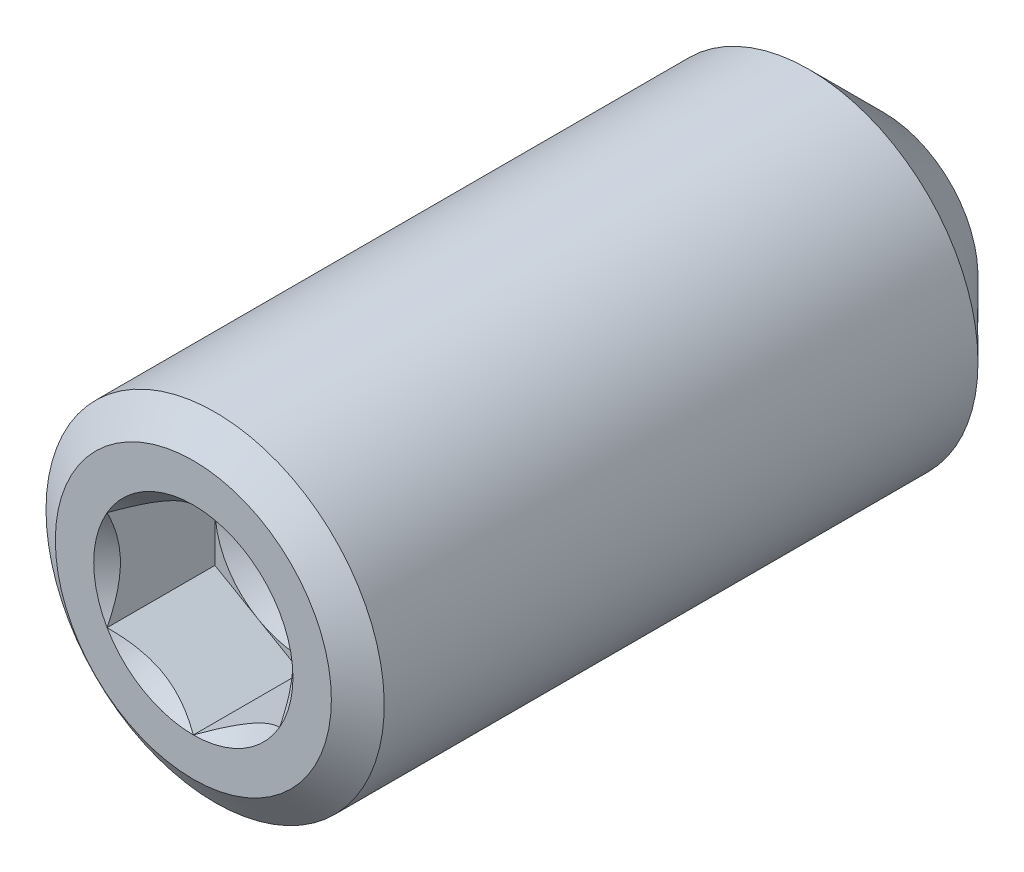
ISO-10303-21;
HEADER;
FILE_DESCRIPTION(('STEP AP214'),'2;1');
FILE_NAME('part.step','',(''),(''),'','','');
FILE_SCHEMA(('AUTOMOTIVE_DESIGN { 1 0 10303 214 1 1 1 1 }'));
ENDSEC;
DATA;
#1=APPLICATION_CONTEXT('core data for automotive mechanical design processes');
#2=APPLICATION_PROTOCOL_DEFINITION('international standard','automotive_design',2000,#1);
#3=PRODUCT_CONTEXT('',#1,'mechanical');
#4=PRODUCT('Part','Part','',(#3));
#5=PRODUCT_RELATED_PRODUCT_CATEGORY('part','',(#4));
#6=PRODUCT_DEFINITION_FORMATION('','',#4);
#7=PRODUCT_DEFINITION_CONTEXT('part definition',#1,'design');
#8=PRODUCT_DEFINITION('design','',#6,#7);
#9=PRODUCT_DEFINITION_SHAPE('','',#8);
#10=(LENGTH_UNIT() NAMED_UNIT(*) SI_UNIT(.MILLI.,.METRE.));
#11=(NAMED_UNIT(*) PLANE_ANGLE_UNIT() SI_UNIT($,.RADIAN.));
#12=(NAMED_UNIT(*) SI_UNIT($,.STERADIAN.) SOLID_ANGLE_UNIT());
#13=UNCERTAINTY_MEASURE_WITH_UNIT(LENGTH_MEASURE(1.E-05),#10,'distance_accuracy_value','');
#14=(GEOMETRIC_REPRESENTATION_CONTEXT(3) GLOBAL_UNCERTAINTY_ASSIGNED_CONTEXT((#13)) GLOBAL_UNIT_ASSIGNED_CONTEXT((#10,
#11,#12)) REPRESENTATION_CONTEXT('',''));
#15=CARTESIAN_POINT('',(0.,0.,0.));
#16=DIRECTION('',(0.,0.,1.));
#17=DIRECTION('',(1.,0.,0.));
#18=AXIS2_PLACEMENT_3D('',#15,#16,#17);
#19=CARTESIAN_POINT('',(0.,0.,3.02593683397845));
#20=DIRECTION('',(0.,0.,1.));
#21=DIRECTION('',(1.,0.,0.));
#22=AXIS2_PLACEMENT_3D('',#19,#20,#21);
#23=CONICAL_SURFACE('',#22,1.25000000002728,1.04719755119718);
#24=CARTESIAN_POINT('',(0.,0.,3.02593683397845));
#25=DIRECTION('',(0.,0.,1.));
#26=DIRECTION('',(1.,0.,0.));
#27=AXIS2_PLACEMENT_3D('',#24,#25,#26);
#28=CIRCLE('',#27,1.25000000002728);
#29=CARTESIAN_POINT('',(-1.25000000001364,0.,3.02593683398803));
#30=VERTEX_POINT('',#29);
#31=CARTESIAN_POINT('',(-0.625000000006821,1.08253175474237,3.02593683398803));
#32=VERTEX_POINT('',#31);
#33=EDGE_CURVE('E93',#30,#32,#28,.F.);
#34=ORIENTED_EDGE('',*,*,#33,.F.);
#35=CARTESIAN_POINT('',(0.,0.,3.02593683397845));
#36=DIRECTION('',(0.,0.,1.));
#37=DIRECTION('',(1.,0.,0.));
#38=AXIS2_PLACEMENT_3D('',#35,#36,#37);
#39=CIRCLE('',#38,1.25000000002728);
#40=CARTESIAN_POINT('',(-0.625000000006821,-1.08253175474236,3.02593683398803));
#41=VERTEX_POINT('',#40);
#42=EDGE_CURVE('E20',#41,#30,#39,.F.);
#43=ORIENTED_EDGE('',*,*,#42,.F.);
#44=CARTESIAN_POINT('',(0.,0.,3.02593683397845));
#45=DIRECTION('',(0.,0.,1.));
#46=DIRECTION('',(1.,0.,0.));
#47=AXIS2_PLACEMENT_3D('',#44,#45,#46);
#48=CIRCLE('',#47,1.25000000002728);
#49=CARTESIAN_POINT('',(0.625000000006821,-1.08253175474236,3.02593683398803));
#50=VERTEX_POINT('',#49);
#51=EDGE_CURVE('E90',#50,#41,#48,.F.);
#52=ORIENTED_EDGE('',*,*,#51,.F.);
#53=CARTESIAN_POINT('',(0.,0.,3.02593683397845));
#54=DIRECTION('',(0.,0.,1.));
#55=DIRECTION('',(1.,0.,0.));
#56=AXIS2_PLACEMENT_3D('',#53,#54,#55);
#57=CIRCLE('',#56,1.25000000002728);
#58=CARTESIAN_POINT('',(1.25000000001364,0.,3.02593683398803));
#59=VERTEX_POINT('',#58);
#60=EDGE_CURVE('E113',#59,#50,#57,.F.);
#61=ORIENTED_EDGE('',*,*,#60,.F.);
#62=CARTESIAN_POINT('',(0.,0.,3.02593683397845));
#63=DIRECTION('',(0.,0.,1.));
#64=DIRECTION('',(1.,0.,0.));
#65=AXIS2_PLACEMENT_3D('',#62,#63,#64);
#66=CIRCLE('',#65,1.25000000002728);
#67=CARTESIAN_POINT('',(0.62500000000682,1.08253175474236,3.02593683398803));
#68=VERTEX_POINT('',#67);
#69=EDGE_CURVE('E346',#68,#59,#66,.F.);
#70=ORIENTED_EDGE('',*,*,#69,.F.);
#71=CARTESIAN_POINT('',(0.,0.,3.02593683397845));
#72=DIRECTION('',(0.,0.,1.));
#73=DIRECTION('',(1.,0.,0.));
#74=AXIS2_PLACEMENT_3D('',#71,#72,#73);
#75=CIRCLE('',#74,1.25000000002728);
#76=EDGE_CURVE('E350',#32,#68,#75,.F.);
#77=ORIENTED_EDGE('',*,*,#76,.F.);
#78=EDGE_LOOP('',(#34,#43,#52,#61,#70,#77));
#79=FACE_BOUND('',#78,.T.);
#80=CARTESIAN_POINT('',(-1.70530256582424E-10,0.,2.30424899757509));
#81=VERTEX_POINT('',#80);
#82=VERTEX_LOOP('',#81);
#83=FACE_BOUND('',#82,.T.);
#84=ADVANCED_FACE('F17',(#79,#83),#23,.F.);
#85=CARTESIAN_POINT('',(-1.25,2.1650635094611,3.02593683399762));
#86=DIRECTION('',(0.,0.,1.));
#87=DIRECTION('',(1.,0.,0.));
#88=AXIS2_PLACEMENT_3D('',#85,#86,#87);
#89=PLANE('',#88);
#90=DIRECTION('',(0.,-1.,0.));
#91=VECTOR('',#90,1.);
#92=CARTESIAN_POINT('',(-1.25,0.721687836487036,3.02593683399762));
#93=LINE('',#92,#91);
#94=CARTESIAN_POINT('',(-1.24999999999998,-0.721687836487046,3.02593683399762));
#95=VERTEX_POINT('',#94);
#96=EDGE_CURVE('E100',#30,#95,#93,.T.);
#97=ORIENTED_EDGE('',*,*,#96,.T.);
#98=DIRECTION('',(0.866025403784438,-0.5,0.));
#99=VECTOR('',#98,1.);
#100=CARTESIAN_POINT('',(-1.25,-0.721687836487028,3.02593683399762));
#101=LINE('',#100,#99);
#102=EDGE_CURVE('E98',#95,#41,#101,.T.);
#103=ORIENTED_EDGE('',*,*,#102,.T.);
#104=ORIENTED_EDGE('',*,*,#42,.T.);
#105=EDGE_LOOP('',(#97,#103,#104));
#106=FACE_BOUND('',#105,.T.);
#107=ADVANCED_FACE('F99',(#106),#89,.T.);
#108=CARTESIAN_POINT('',(-1.25,2.1650635094611,3.02593683399762));
#109=DIRECTION('',(0.,0.,1.));
#110=DIRECTION('',(1.,0.,0.));
#111=AXIS2_PLACEMENT_3D('',#108,#109,#110);
#112=PLANE('',#111);
#113=DIRECTION('',(0.866025403784438,-0.5,0.));
#114=VECTOR('',#113,1.);
#115=CARTESIAN_POINT('',(-1.25,-0.721687836487028,3.02593683399762));
#116=LINE('',#115,#114);
#117=CARTESIAN_POINT('',(0.,-1.44337567297406,3.02593683399762));
#118=VERTEX_POINT('',#117);
#119=EDGE_CURVE('E105',#41,#118,#116,.T.);
#120=ORIENTED_EDGE('',*,*,#119,.T.);
#121=DIRECTION('',(0.866025403784439,0.5,0.));
#122=VECTOR('',#121,1.);
#123=CARTESIAN_POINT('',(0.,-1.44337567297406,3.02593683399762));
#124=LINE('',#123,#122);
#125=EDGE_CURVE('E111',#118,#50,#124,.T.);
#126=ORIENTED_EDGE('',*,*,#125,.T.);
#127=ORIENTED_EDGE('',*,*,#51,.T.);
#128=EDGE_LOOP('',(#120,#126,#127));
#129=FACE_BOUND('',#128,.T.);
#130=ADVANCED_FACE('F108',(#129),#112,.T.);
#131=CARTESIAN_POINT('',(-1.25,2.1650635094611,3.02593683399762));
#132=DIRECTION('',(0.,0.,1.));
#133=DIRECTION('',(1.,0.,0.));
#134=AXIS2_PLACEMENT_3D('',#131,#132,#133);
#135=PLANE('',#134);
#136=DIRECTION('',(0.866025403784439,0.5,0.));
#137=VECTOR('',#136,1.);
#138=CARTESIAN_POINT('',(0.,-1.44337567297406,3.02593683399762));
#139=LINE('',#138,#137);
#140=CARTESIAN_POINT('',(1.25,-0.721687836487004,3.02593683399762));
#141=VERTEX_POINT('',#140);
#142=EDGE_CURVE('E127',#50,#141,#139,.T.);
#143=ORIENTED_EDGE('',*,*,#142,.T.);
#144=DIRECTION('',(0.,1.,0.));
#145=VECTOR('',#144,1.);
#146=CARTESIAN_POINT('',(1.25,-0.721687836487031,3.02593683399762));
#147=LINE('',#146,#145);
#148=EDGE_CURVE('E310',#141,#59,#147,.T.);
#149=ORIENTED_EDGE('',*,*,#148,.T.);
#150=ORIENTED_EDGE('',*,*,#60,.T.);
#151=EDGE_LOOP('',(#143,#149,#150));
#152=FACE_BOUND('',#151,.T.);
#153=ADVANCED_FACE('F341',(#152),#135,.T.);
#154=CARTESIAN_POINT('',(-1.25,2.1650635094611,3.02593683399762));
#155=DIRECTION('',(0.,0.,1.));
#156=DIRECTION('',(1.,0.,0.));
#157=AXIS2_PLACEMENT_3D('',#154,#155,#156);
#158=PLANE('',#157);
#159=DIRECTION('',(0.,1.,0.));
#160=VECTOR('',#159,1.);
#161=CARTESIAN_POINT('',(1.25,-0.721687836487031,3.02593683399762));
#162=LINE('',#161,#160);
#163=CARTESIAN_POINT('',(1.24999999999996,0.721687836487064,3.02593683399762));
#164=VERTEX_POINT('',#163);
#165=EDGE_CURVE('E306',#59,#164,#162,.T.);
#166=ORIENTED_EDGE('',*,*,#165,.T.);
#167=DIRECTION('',(-0.866025403784439,0.5,0.));
#168=VECTOR('',#167,1.);
#169=CARTESIAN_POINT('',(1.25,0.721687836487033,3.02593683399762));
#170=LINE('',#169,#168);
#171=EDGE_CURVE('E305',#164,#68,#170,.T.);
#172=ORIENTED_EDGE('',*,*,#171,.T.);
#173=ORIENTED_EDGE('',*,*,#69,.T.);
#174=EDGE_LOOP('',(#166,#172,#173));
#175=FACE_BOUND('',#174,.T.);
#176=ADVANCED_FACE('F347',(#175),#158,.T.);
#177=CARTESIAN_POINT('',(-1.25,2.1650635094611,3.02593683399762));
#178=DIRECTION('',(0.,0.,1.));
#179=DIRECTION('',(1.,0.,0.));
#180=AXIS2_PLACEMENT_3D('',#177,#178,#179);
#181=PLANE('',#180);
#182=DIRECTION('',(-0.866025403784439,0.5,0.));
#183=VECTOR('',#182,1.);
#184=CARTESIAN_POINT('',(1.25,0.721687836487033,3.02593683399762));
#185=LINE('',#184,#183);
#186=CARTESIAN_POINT('',(0.,1.44337567297407,3.02593683399762));
#187=VERTEX_POINT('',#186);
#188=EDGE_CURVE('E299',#68,#187,#185,.T.);
#189=ORIENTED_EDGE('',*,*,#188,.T.);
#190=DIRECTION('',(-0.866025403784439,-0.5,0.));
#191=VECTOR('',#190,1.);
#192=CARTESIAN_POINT('',(0.,1.44337567297407,3.02593683399762));
#193=LINE('',#192,#191);
#194=EDGE_CURVE('E298',#187,#32,#193,.T.);
#195=ORIENTED_EDGE('',*,*,#194,.T.);
#196=ORIENTED_EDGE('',*,*,#76,.T.);
#197=EDGE_LOOP('',(#189,#195,#196));
#198=FACE_BOUND('',#197,.T.);
#199=ADVANCED_FACE('F359',(#198),#181,.T.);
#200=CARTESIAN_POINT('',(-1.25,2.1650635094611,3.02593683399762));
#201=DIRECTION('',(0.,0.,1.));
#202=DIRECTION('',(1.,0.,0.));
#203=AXIS2_PLACEMENT_3D('',#200,#201,#202);
#204=PLANE('',#203);
#205=DIRECTION('',(-0.866025403784439,-0.5,0.));
#206=VECTOR('',#205,1.);
#207=CARTESIAN_POINT('',(0.,1.44337567297407,3.02593683399762));
#208=LINE('',#207,#206);
#209=CARTESIAN_POINT('',(-1.25,0.721687836487035,3.02593683399762));
#210=VERTEX_POINT('',#209);
#211=EDGE_CURVE('E292',#32,#210,#208,.T.);
#212=ORIENTED_EDGE('',*,*,#211,.T.);
#213=DIRECTION('',(0.,-1.,0.));
#214=VECTOR('',#213,1.);
#215=CARTESIAN_POINT('',(-1.25,0.721687836487036,3.02593683399762));
#216=LINE('',#215,#214);
#217=EDGE_CURVE('E131',#210,#30,#216,.T.);
#218=ORIENTED_EDGE('',*,*,#217,.T.);
#219=ORIENTED_EDGE('',*,*,#33,.T.);
#220=EDGE_LOOP('',(#212,#218,#219));
#221=FACE_BOUND('',#220,.T.);
#222=ADVANCED_FACE('F364',(#221),#204,.T.);
#223=CARTESIAN_POINT('',(-1.25,0.721687836487036,3.02593683399762));
#224=DIRECTION('',(-1.,0.,0.));
#225=DIRECTION('',(0.,-1.,0.));
#226=AXIS2_PLACEMENT_3D('',#223,#224,#225);
#227=PLANE('',#226);
#228=CARTESIAN_POINT('',(-1.25,0.721687836485506,4.58843683400859));
#229=CARTESIAN_POINT('',(-1.25,0.67207831196557,4.56365587372669));
#230=CARTESIAN_POINT('',(-1.25,0.621639311734547,4.54033058347148));
#231=CARTESIAN_POINT('',(-1.25,0.518789014124005,4.49762297291883));
#232=CARTESIAN_POINT('',(-1.25,0.466367941020541,4.478264407358));
#233=CARTESIAN_POINT('',(-1.25,0.360663425295405,4.44510304991205));
#234=CARTESIAN_POINT('',(-1.25,0.307406887809592,4.4312169307825));
#235=CARTESIAN_POINT('',(-1.25,0.199721668828178,4.40982273579902));
#236=CARTESIAN_POINT('',(-1.25,0.14529627466345,4.40229869592082));
#237=CARTESIAN_POINT('',(-1.25,0.0514891518506942,4.39550966179547));
#238=CARTESIAN_POINT('',(-1.25,0.0122284842203182,4.39450502265398));
#239=CARTESIAN_POINT('',(-1.25,-0.066223744792929,4.39620032922052));
#240=CARTESIAN_POINT('',(-1.25,-0.105415288995824,4.39890109326086));
#241=CARTESIAN_POINT('',(-1.25,-0.183420000810623,4.40785108234422));
#242=CARTESIAN_POINT('',(-1.25,-0.222232782388906,4.41410360705652));
#243=CARTESIAN_POINT('',(-1.25,-0.299210321209828,4.42982037324484));
#244=CARTESIAN_POINT('',(-1.25,-0.337374792996399,4.43928599285774));
#245=CARTESIAN_POINT('',(-1.25,-0.435075493648963,4.46736516557929));
#246=CARTESIAN_POINT('',(-1.25,-0.493996912444486,4.48808617906275));
#247=CARTESIAN_POINT('',(-1.25,-0.609534537983697,4.53476033981849));
#248=CARTESIAN_POINT('',(-1.25,-0.666157545656916,4.56069645523039));
#249=CARTESIAN_POINT('',(-1.25,-0.721687836485585,4.58843683400865));
#250=B_SPLINE_CURVE_WITH_KNOTS('',3,(#228,#229,#230,#231,#232,#233,#234,#235,#236,#237,#238,
#239,#240,#241,#242,#243,#244,#245,#246,#247,#248,#249),.UNSPECIFIED.,.F.,.F.,(4,2,2,2,2,2,2,2,
2,2,4),(0.,0.166478683225483,0.333926926832097,0.49871665851735,0.663091654627106,
0.780745575559074,0.898425484352099,1.01621489977086,1.13405490052503,1.32111591641343,
1.50757565758287),.UNSPECIFIED.);
#251=CARTESIAN_POINT('',(-1.25000000000141,0.721687836487026,4.58843683401057));
#252=VERTEX_POINT('',#251);
#253=CARTESIAN_POINT('',(-1.25000000000209,-0.72168783648582,4.58843683401059));
#254=VERTEX_POINT('',#253);
#255=EDGE_CURVE('E235',#252,#254,#250,.T.);
#256=ORIENTED_EDGE('',*,*,#255,.T.);
#257=DIRECTION('',(0.,0.,1.));
#258=VECTOR('',#257,1.);
#259=CARTESIAN_POINT('',(-1.24999999999997,-0.721687836487046,3.02593683399762));
#260=LINE('',#259,#258);
#261=EDGE_CURVE('E117',#254,#95,#260,.F.);
#262=ORIENTED_EDGE('',*,*,#261,.T.);
#263=ORIENTED_EDGE('',*,*,#96,.F.);
#264=ORIENTED_EDGE('',*,*,#217,.F.);
#265=DIRECTION('',(0.,0.,1.));
#266=VECTOR('',#265,1.);
#267=CARTESIAN_POINT('',(-1.25,0.721687836487035,3.02593683399762));
#268=LINE('',#267,#266);
#269=EDGE_CURVE('E288',#210,#252,#268,.T.);
#270=ORIENTED_EDGE('',*,*,#269,.T.);
#271=EDGE_LOOP('',(#256,#262,#263,#264,#270));
#272=FACE_BOUND('',#271,.T.);
#273=ADVANCED_FACE('F226',(#272),#227,.F.);
#274=CARTESIAN_POINT('',(-1.25,-0.721687836487028,3.02593683399762));
#275=DIRECTION('',(-0.5,-0.866025403784438,0.));
#276=DIRECTION('',(0.866025403784438,-0.5,0.));
#277=AXIS2_PLACEMENT_3D('',#274,#275,#276);
#278=PLANE('',#277);
#279=CARTESIAN_POINT('',(-1.24999999999869,-0.721687836487788,4.58843683400862));
#280=CARTESIAN_POINT('',(-1.20703689149475,-0.746492598747757,4.56365587372672));
#281=CARTESIAN_POINT('',(-1.16335543595319,-0.77171209886327,4.54033058347151));
#282=CARTESIAN_POINT('',(-1.07428446543567,-0.823137247668542,4.49762297291886));
#283=CARTESIAN_POINT('',(-1.02888648443443,-0.849347784220275,4.47826440735802));
#284=CARTESIAN_POINT('',(-0.937343688521729,-0.902200042082844,4.44510304991208));
#285=CARTESIAN_POINT('',(-0.891222174141415,-0.928828310825752,4.43121693078252));
#286=CARTESIAN_POINT('',(-0.797964038891418,-0.98267092031646,4.40982273579905));
#287=CARTESIAN_POINT('',(-0.75083026493378,-1.00988361739883,4.40229869592084));
#288=CARTESIAN_POINT('',(-0.669590913522005,-1.0567871788052,4.39550966179549));
#289=CARTESIAN_POINT('',(-0.635590177984561,-1.07641751262039,4.394505022654));
#290=CARTESIAN_POINT('',(-0.567648554675573,-1.11564362712702,4.39620032922055));
#291=CARTESIAN_POINT('',(-0.533707681782325,-1.13523939922847,4.39890109326088));
#292=CARTESIAN_POINT('',(-0.466153619735823,-1.17424175513587,4.40785108234424));
#293=CARTESIAN_POINT('',(-0.432540764897493,-1.19364814592501,4.41410360705654));
#294=CARTESIAN_POINT('',(-0.36587626075777,-1.23213691533547,4.42982037324486));
#295=CARTESIAN_POINT('',(-0.332824858668585,-1.25121915122876,4.43928599285776));
#296=CARTESIAN_POINT('',(-0.248213569935932,-1.30006950155503,4.46736516557931));
#297=CARTESIAN_POINT('',(-0.197186124431993,-1.32953021095279,4.48808617906277));
#298=CARTESIAN_POINT('',(-0.0971276056221142,-1.38729902372239,4.5347603398185));
#299=CARTESIAN_POINT('',(-0.0480906425384311,-1.415610527559,4.5606964552304));
#300=CARTESIAN_POINT('',(-1.27108631816788E-12,-1.44337567297333,4.58843683400866));
#301=B_SPLINE_CURVE_WITH_KNOTS('',3,(#279,#280,#281,#282,#283,#284,#285,#286,#287,#288,#289,
#290,#291,#292,#293,#294,#295,#296,#297,#298,#299,#300),.UNSPECIFIED.,.F.,.F.,(4,2,2,2,2,2,2,2,
2,2,4),(0.,0.166478683225488,0.333926926832108,0.498716658517365,0.663091654627127,
0.780745575559097,0.898425484352125,1.01621489977089,1.13405490052506,1.32111591641343,
1.50757565758286),.UNSPECIFIED.);
#302=CARTESIAN_POINT('',(-2.08582432422679E-12,-1.44337567297527,4.58843683401059));
#303=VERTEX_POINT('',#302);
#304=EDGE_CURVE('E229',#254,#303,#301,.T.);
#305=ORIENTED_EDGE('',*,*,#304,.T.);
#306=DIRECTION('',(0.,0.,1.));
#307=VECTOR('',#306,1.);
#308=CARTESIAN_POINT('',(0.,-1.44337567297405,3.02593683399762));
#309=LINE('',#308,#307);
#310=EDGE_CURVE('E116',#303,#118,#309,.F.);
#311=ORIENTED_EDGE('',*,*,#310,.T.);
#312=ORIENTED_EDGE('',*,*,#119,.F.);
#313=ORIENTED_EDGE('',*,*,#102,.F.);
#314=ORIENTED_EDGE('',*,*,#261,.F.);
#315=EDGE_LOOP('',(#305,#311,#312,#313,#314));
#316=FACE_BOUND('',#315,.T.);
#317=ADVANCED_FACE('F114',(#316),#278,.F.);
#318=CARTESIAN_POINT('',(0.,-1.44337567297406,3.02593683399762));
#319=DIRECTION('',(0.5,-0.866025403784439,0.));
#320=DIRECTION('',(0.866025403784439,0.5,0.));
#321=AXIS2_PLACEMENT_3D('',#318,#319,#320);
#322=PLANE('',#321);
#323=CARTESIAN_POINT('',(1.30846630177461E-12,-1.44337567297331,4.58843683400864));
#324=CARTESIAN_POINT('',(0.0429631085052433,-1.41857091071334,4.56365587372674));
#325=CARTESIAN_POINT('',(0.086644564046802,-1.39335141059782,4.54033058347152));
#326=CARTESIAN_POINT('',(0.175715534564327,-1.34192626179255,4.49762297291887));
#327=CARTESIAN_POINT('',(0.221113515565572,-1.31571572524081,4.47826440735803));
#328=CARTESIAN_POINT('',(0.312656311478277,-1.26286346737824,4.44510304991208));
#329=CARTESIAN_POINT('',(0.358777825858593,-1.23623519863533,4.43121693078253));
#330=CARTESIAN_POINT('',(0.452035961108595,-1.18239258914462,4.40982273579905));
#331=CARTESIAN_POINT('',(0.499169735066234,-1.15517989206226,4.40229869592084));
#332=CARTESIAN_POINT('',(0.580409086478012,-1.10827633065588,4.39550966179549));
#333=CARTESIAN_POINT('',(0.614409822015456,-1.08864599684069,4.394505022654));
#334=CARTESIAN_POINT('',(0.682351445324444,-1.04941988233406,4.39620032922055));
#335=CARTESIAN_POINT('',(0.716292318217692,-1.02982411023262,4.39890109326088));
#336=CARTESIAN_POINT('',(0.783846380264195,-0.990821754325215,4.40785108234424));
#337=CARTESIAN_POINT('',(0.817459235102524,-0.971415363536073,4.41410360705654));
#338=CARTESIAN_POINT('',(0.884123739242248,-0.932926594125612,4.42982037324486));
#339=CARTESIAN_POINT('',(0.917175141331433,-0.913844358232325,4.43928599285776));
#340=CARTESIAN_POINT('',(1.00178643006409,-0.864994007906047,4.46736516557931));
#341=CARTESIAN_POINT('',(1.05281387556803,-0.835533298508289,4.48808617906276));
#342=CARTESIAN_POINT('',(1.1528723943779,-0.77776448573869,4.5347603398185));
#343=CARTESIAN_POINT('',(1.20190935746159,-0.749452981902084,4.5606964552304));
#344=CARTESIAN_POINT('',(1.24999999999875,-0.721687836487752,4.58843683400866));
#345=B_SPLINE_CURVE_WITH_KNOTS('',3,(#323,#324,#325,#326,#327,#328,#329,#330,#331,#332,#333,
#334,#335,#336,#337,#338,#339,#340,#341,#342,#343,#344),.UNSPECIFIED.,.F.,.F.,(4,2,2,2,2,2,2,2,
2,2,4),(0.,0.166478683225496,0.333926926832123,0.498716658517387,0.663091654627158,
0.780745575559128,0.898425484352156,1.01621489977092,1.13405490052509,1.32111591641346,
1.50757565758289),.UNSPECIFIED.);
#346=CARTESIAN_POINT('',(1.25,-0.721687836489449,4.58843683401059));
#347=VERTEX_POINT('',#346);
#348=EDGE_CURVE('E205',#303,#347,#345,.T.);
#349=ORIENTED_EDGE('',*,*,#348,.T.);
#350=DIRECTION('',(0.,0.,-1.));
#351=VECTOR('',#350,1.);
#352=CARTESIAN_POINT('',(1.25,-0.721687836486995,3.02593683399762));
#353=LINE('',#352,#351);
#354=EDGE_CURVE('E302',#347,#141,#353,.T.);
#355=ORIENTED_EDGE('',*,*,#354,.T.);
#356=ORIENTED_EDGE('',*,*,#142,.F.);
#357=ORIENTED_EDGE('',*,*,#125,.F.);
#358=ORIENTED_EDGE('',*,*,#310,.F.);
#359=EDGE_LOOP('',(#349,#355,#356,#357,#358));
#360=FACE_BOUND('',#359,.T.);
#361=ADVANCED_FACE('F216',(#360),#322,.F.);
#362=CARTESIAN_POINT('',(1.25,-0.721687836487031,3.02593683399762));
#363=DIRECTION('',(1.,0.,0.));
#364=DIRECTION('',(0.,0.,-1.));
#365=AXIS2_PLACEMENT_3D('',#362,#363,#364);
#366=PLANE('',#365);
#367=CARTESIAN_POINT('',(1.25,-0.721687836485512,4.58843683400862));
#368=CARTESIAN_POINT('',(1.25,-0.672078311965572,4.56365587372672));
#369=CARTESIAN_POINT('',(1.25,-0.621639311734545,4.54033058347151));
#370=CARTESIAN_POINT('',(1.25,-0.518789014123995,4.49762297291884));
#371=CARTESIAN_POINT('',(1.25,-0.466367941020527,4.47826440735801));
#372=CARTESIAN_POINT('',(1.25,-0.360663425295383,4.44510304991206));
#373=CARTESIAN_POINT('',(1.25,-0.307406887809565,4.4312169307825));
#374=CARTESIAN_POINT('',(1.25,-0.199721668828143,4.40982273579903));
#375=CARTESIAN_POINT('',(1.25,-0.14529627466341,4.40229869592082));
#376=CARTESIAN_POINT('',(1.25,-0.0514891518506491,4.39550966179547));
#377=CARTESIAN_POINT('',(1.25,-0.0122284842202729,4.39450502265398));
#378=CARTESIAN_POINT('',(1.25,0.0662237447929748,4.39620032922052));
#379=CARTESIAN_POINT('',(1.25,0.10541528899587,4.39890109326086));
#380=CARTESIAN_POINT('',(1.25,0.18342000081067,4.40785108234421));
#381=CARTESIAN_POINT('',(1.25,0.222232782388952,4.41410360705652));
#382=CARTESIAN_POINT('',(1.25,0.299210321209875,4.42982037324483));
#383=CARTESIAN_POINT('',(1.25,0.337374792996446,4.43928599285774));
#384=CARTESIAN_POINT('',(1.25,0.435075493649011,4.46736516557928));
#385=CARTESIAN_POINT('',(1.25,0.493996912444534,4.48808617906274));
#386=CARTESIAN_POINT('',(1.25,0.609534537983747,4.53476033981849));
#387=CARTESIAN_POINT('',(1.25,0.666157545656967,4.56069645523039));
#388=CARTESIAN_POINT('',(1.25,0.721687836485637,4.58843683400865));
#389=B_SPLINE_CURVE_WITH_KNOTS('',3,(#367,#368,#369,#370,#371,#372,#373,#374,#375,#376,#377,
#378,#379,#380,#381,#382,#383,#384,#385,#386,#387,#388),.UNSPECIFIED.,.F.,.F.,(4,2,2,2,2,2,2,2,
2,2,4),(0.,0.166478683225497,0.333926926832126,0.498716658517393,0.663091654627164,
0.780745575559132,0.898425484352158,1.01621489977092,1.13405490052509,1.32111591641349,
1.50757565758294),.UNSPECIFIED.);
#390=CARTESIAN_POINT('',(1.25000000000211,0.721687836485813,4.58843683401057));
#391=VERTEX_POINT('',#390);
#392=EDGE_CURVE('E198',#347,#391,#389,.T.);
#393=ORIENTED_EDGE('',*,*,#392,.T.);
#394=DIRECTION('',(0.,0.,1.));
#395=VECTOR('',#394,1.);
#396=CARTESIAN_POINT('',(1.24999999999994,0.721687836487064,3.02593683399762));
#397=LINE('',#396,#395);
#398=EDGE_CURVE('E295',#391,#164,#397,.F.);
#399=ORIENTED_EDGE('',*,*,#398,.T.);
#400=ORIENTED_EDGE('',*,*,#165,.F.);
#401=ORIENTED_EDGE('',*,*,#148,.F.);
#402=ORIENTED_EDGE('',*,*,#354,.F.);
#403=EDGE_LOOP('',(#393,#399,#400,#401,#402));
#404=FACE_BOUND('',#403,.T.);
#405=ADVANCED_FACE('F212',(#404),#366,.F.);
#406=CARTESIAN_POINT('',(1.25,0.721687836487033,3.02593683399762));
#407=DIRECTION('',(0.5,0.866025403784439,0.));
#408=DIRECTION('',(-0.866025403784439,0.5,0.));
#409=AXIS2_PLACEMENT_3D('',#406,#407,#408);
#410=PLANE('',#409);
#411=CARTESIAN_POINT('',(1.24999999999867,0.721687836487798,4.58843683400858));
#412=CARTESIAN_POINT('',(1.20703689149474,0.746492598747767,4.56365587372669));
#413=CARTESIAN_POINT('',(1.16335543595318,0.77171209886328,4.54033058347148));
#414=CARTESIAN_POINT('',(1.07428446543566,0.823137247668553,4.49762297291882));
#415=CARTESIAN_POINT('',(1.02888648443442,0.849347784220287,4.47826440735798));
#416=CARTESIAN_POINT('',(0.937343688521714,0.902200042082856,4.44510304991204));
#417=CARTESIAN_POINT('',(0.891222174141399,0.928828310825765,4.43121693078248));
#418=CARTESIAN_POINT('',(0.7979640388914,0.982670920316474,4.409822735799));
#419=CARTESIAN_POINT('',(0.750830264933761,1.00988361739884,4.40229869592079));
#420=CARTESIAN_POINT('',(0.669590913521986,1.05678717880522,4.39550966179545));
#421=CARTESIAN_POINT('',(0.635590177984544,1.07641751262041,4.39450502265395));
#422=CARTESIAN_POINT('',(0.567648554675558,1.11564362712703,4.3962003292205));
#423=CARTESIAN_POINT('',(0.533707681782311,1.13523939922848,4.39890109326084));
#424=CARTESIAN_POINT('',(0.466153619735811,1.17424175513588,4.40785108234419));
#425=CARTESIAN_POINT('',(0.432540764897482,1.19364814592502,4.4141036070565));
#426=CARTESIAN_POINT('',(0.365876260757762,1.23213691533548,4.42982037324481));
#427=CARTESIAN_POINT('',(0.332824858668577,1.25121915122876,4.43928599285771));
#428=CARTESIAN_POINT('',(0.248213569935926,1.30006950155504,4.46736516557926));
#429=CARTESIAN_POINT('',(0.197186124431987,1.3295302109528,4.48808617906271));
#430=CARTESIAN_POINT('',(0.0971276056221083,1.3872990237224,4.53476033981845));
#431=CARTESIAN_POINT('',(0.048090642538425,1.415610527559,4.56069645523034));
#432=CARTESIAN_POINT('',(1.26510093932132E-12,1.44337567297333,4.58843683400861));
#433=B_SPLINE_CURVE_WITH_KNOTS('',3,(#411,#412,#413,#414,#415,#416,#417,#418,#419,#420,#421,
#422,#423,#424,#425,#426,#427,#428,#429,#430,#431,#432),.UNSPECIFIED.,.F.,.F.,(4,2,2,2,2,2,2,2,
2,2,4),(0.,0.166478683225491,0.333926926832114,0.498716658517375,0.66309165462714,
0.780745575559106,0.89842548435213,1.01621489977089,1.13405490052505,1.32111591641343,
1.50757565758285),.UNSPECIFIED.);
#434=CARTESIAN_POINT('',(2.15224813459051E-12,1.44337567297531,4.58843683401058));
#435=VERTEX_POINT('',#434);
#436=EDGE_CURVE('E167',#391,#435,#433,.T.);
#437=ORIENTED_EDGE('',*,*,#436,.T.);
#438=DIRECTION('',(0.,0.,1.));
#439=VECTOR('',#438,1.);
#440=CARTESIAN_POINT('',(0.,1.44337567297407,3.02593683399762));
#441=LINE('',#440,#439);
#442=EDGE_CURVE('E285',#435,#187,#441,.F.);
#443=ORIENTED_EDGE('',*,*,#442,.T.);
#444=ORIENTED_EDGE('',*,*,#188,.F.);
#445=ORIENTED_EDGE('',*,*,#171,.F.);
#446=ORIENTED_EDGE('',*,*,#398,.F.);
#447=EDGE_LOOP('',(#437,#443,#444,#445,#446));
#448=FACE_BOUND('',#447,.T.);
#449=ADVANCED_FACE('F215',(#448),#410,.F.);
#450=CARTESIAN_POINT('',(0.,1.44337567297407,3.02593683399762));
#451=DIRECTION('',(-0.5,0.866025403784439,0.));
#452=DIRECTION('',(-0.866025403784439,-0.5,0.));
#453=AXIS2_PLACEMENT_3D('',#450,#451,#452);
#454=PLANE('',#453);
#455=CARTESIAN_POINT('',(-1.26613449305235E-12,1.44337567297334,4.58843683400861));
#456=CARTESIAN_POINT('',(-0.042963108505202,1.41857091071337,4.56365587372671));
#457=CARTESIAN_POINT('',(-0.0866445640467617,1.39335141059785,4.54033058347149));
#458=CARTESIAN_POINT('',(-0.175715534564289,1.34192626179258,4.49762297291883));
#459=CARTESIAN_POINT('',(-0.221113515565535,1.31571572524084,4.478264407358));
#460=CARTESIAN_POINT('',(-0.312656311478243,1.26286346737827,4.44510304991204));
#461=CARTESIAN_POINT('',(-0.35877782585856,1.23623519863536,4.43121693078248));
#462=CARTESIAN_POINT('',(-0.452035961108564,1.18239258914465,4.40982273579901));
#463=CARTESIAN_POINT('',(-0.499169735066205,1.15517989206228,4.4022986959208));
#464=CARTESIAN_POINT('',(-0.580409086477983,1.1082763306559,4.39550966179545));
#465=CARTESIAN_POINT('',(-0.614409822015426,1.08864599684071,4.39450502265395));
#466=CARTESIAN_POINT('',(-0.682351445324412,1.04941988233409,4.3962003292205));
#467=CARTESIAN_POINT('',(-0.716292318217659,1.02982411023264,4.39890109326084));
#468=CARTESIAN_POINT('',(-0.783846380264159,0.990821754325241,4.40785108234419));
#469=CARTESIAN_POINT('',(-0.817459235102488,0.971415363536099,4.4141036070565));
#470=CARTESIAN_POINT('',(-0.884123739242209,0.932926594125639,4.42982037324481));
#471=CARTESIAN_POINT('',(-0.917175141331394,0.913844358232353,4.43928599285771));
#472=CARTESIAN_POINT('',(-1.00178643006406,0.864994007906067,4.46736516557926));
#473=CARTESIAN_POINT('',(-1.05281387556801,0.8355332985083,4.48808617906273));
#474=CARTESIAN_POINT('',(-1.15287239437792,0.777764485738684,4.53476033981848));
#475=CARTESIAN_POINT('',(-1.20190935746162,0.74945298190207,4.56069645523038));
#476=CARTESIAN_POINT('',(-1.24999999999879,0.721687836487731,4.58843683400866));
#477=B_SPLINE_CURVE_WITH_KNOTS('',3,(#455,#456,#457,#458,#459,#460,#461,#462,#463,#464,#465,
#466,#467,#468,#469,#470,#471,#472,#473,#474,#475,#476),.UNSPECIFIED.,.F.,.F.,(4,2,2,2,2,2,2,2,
2,2,4),(0.,0.166478683225501,0.333926926832135,0.498716658517405,0.663091654627179,
0.780745575559146,0.89842548435217,1.01621489977093,1.13405490052509,1.32111591641353,
1.50757565758301),.UNSPECIFIED.);
#478=EDGE_CURVE('E158',#435,#252,#477,.T.);
#479=ORIENTED_EDGE('',*,*,#478,.T.);
#480=ORIENTED_EDGE('',*,*,#269,.F.);
#481=ORIENTED_EDGE('',*,*,#211,.F.);
#482=ORIENTED_EDGE('',*,*,#194,.F.);
#483=ORIENTED_EDGE('',*,*,#442,.F.);
#484=EDGE_LOOP('',(#479,#480,#481,#482,#483));
#485=FACE_BOUND('',#484,.T.);
#486=ADVANCED_FACE('F175',(#485),#454,.F.);
#487=CARTESIAN_POINT('',(0.,0.,4.58843683395571));
#488=DIRECTION('',(0.,0.,1.));
#489=DIRECTION('',(1.,0.,0.));
#490=AXIS2_PLACEMENT_3D('',#487,#488,#489);
#491=CONICAL_SURFACE('',#490,1.44337567292041,0.785398163397448);
#492=ORIENTED_EDGE('',*,*,#255,.F.);
#493=CARTESIAN_POINT('',(0.,0.,4.58843683401255));
#494=DIRECTION('',(0.,0.,1.));
#495=DIRECTION('',(1.,0.,0.));
#496=AXIS2_PLACEMENT_3D('',#493,#494,#495);
#497=CIRCLE('',#496,1.44337567297725);
#498=EDGE_CURVE('E155',#252,#254,#497,.T.);
#499=ORIENTED_EDGE('',*,*,#498,.T.);
#500=EDGE_LOOP('',(#492,#499));
#501=FACE_BOUND('',#500,.T.);
#502=ADVANCED_FACE('F244',(#501),#491,.F.);
#503=CARTESIAN_POINT('',(0.,0.,4.58843683395571));
#504=DIRECTION('',(0.,0.,1.));
#505=DIRECTION('',(1.,0.,0.));
#506=AXIS2_PLACEMENT_3D('',#503,#504,#505);
#507=CONICAL_SURFACE('',#506,1.44337567292041,0.785398163397448);
#508=ORIENTED_EDGE('',*,*,#304,.F.);
#509=CARTESIAN_POINT('',(0.,0.,4.58843683401255));
#510=DIRECTION('',(0.,0.,1.));
#511=DIRECTION('',(1.,0.,0.));
#512=AXIS2_PLACEMENT_3D('',#509,#510,#511);
#513=CIRCLE('',#512,1.44337567297725);
#514=EDGE_CURVE('E152',#254,#303,#513,.T.);
#515=ORIENTED_EDGE('',*,*,#514,.T.);
#516=EDGE_LOOP('',(#508,#515));
#517=FACE_BOUND('',#516,.T.);
#518=ADVANCED_FACE('F241',(#517),#507,.F.);
#519=CARTESIAN_POINT('',(0.,0.,4.58843683395571));
#520=DIRECTION('',(0.,0.,1.));
#521=DIRECTION('',(1.,0.,0.));
#522=AXIS2_PLACEMENT_3D('',#519,#520,#521);
#523=CONICAL_SURFACE('',#522,1.44337567292041,0.785398163397448);
#524=ORIENTED_EDGE('',*,*,#348,.F.);
#525=CARTESIAN_POINT('',(0.,0.,4.58843683401255));
#526=DIRECTION('',(0.,0.,1.));
#527=DIRECTION('',(1.,0.,0.));
#528=AXIS2_PLACEMENT_3D('',#525,#526,#527);
#529=CIRCLE('',#528,1.44337567297725);
#530=EDGE_CURVE('E149',#303,#347,#529,.T.);
#531=ORIENTED_EDGE('',*,*,#530,.T.);
#532=EDGE_LOOP('',(#524,#531));
#533=FACE_BOUND('',#532,.T.);
#534=ADVANCED_FACE('F194',(#533),#523,.F.);
#535=CARTESIAN_POINT('',(0.,0.,4.58843683395571));
#536=DIRECTION('',(0.,0.,1.));
#537=DIRECTION('',(1.,0.,0.));
#538=AXIS2_PLACEMENT_3D('',#535,#536,#537);
#539=CONICAL_SURFACE('',#538,1.44337567292041,0.785398163397448);
#540=CARTESIAN_POINT('',(0.,0.,4.58843683401255));
#541=DIRECTION('',(0.,0.,1.));
#542=DIRECTION('',(1.,0.,0.));
#543=AXIS2_PLACEMENT_3D('',#540,#541,#542);
#544=CIRCLE('',#543,1.44337567297725);
#545=EDGE_CURVE('E146',#347,#391,#544,.T.);
#546=ORIENTED_EDGE('',*,*,#545,.T.);
#547=ORIENTED_EDGE('',*,*,#392,.F.);
#548=EDGE_LOOP('',(#546,#547));
#549=FACE_BOUND('',#548,.T.);
#550=ADVANCED_FACE('F189',(#549),#539,.F.);
#551=CARTESIAN_POINT('',(0.,0.,4.58843683395571));
#552=DIRECTION('',(0.,0.,1.));
#553=DIRECTION('',(1.,0.,0.));
#554=AXIS2_PLACEMENT_3D('',#551,#552,#553);
#555=CONICAL_SURFACE('',#554,1.44337567292041,0.785398163397448);
#556=ORIENTED_EDGE('',*,*,#436,.F.);
#557=CARTESIAN_POINT('',(0.,0.,4.58843683401255));
#558=DIRECTION('',(0.,0.,1.));
#559=DIRECTION('',(1.,0.,0.));
#560=AXIS2_PLACEMENT_3D('',#557,#558,#559);
#561=CIRCLE('',#560,1.44337567297725);
#562=EDGE_CURVE('E143',#391,#435,#561,.T.);
#563=ORIENTED_EDGE('',*,*,#562,.T.);
#564=EDGE_LOOP('',(#556,#563));
#565=FACE_BOUND('',#564,.T.);
#566=ADVANCED_FACE('F183',(#565),#555,.F.);
#567=CARTESIAN_POINT('',(0.,0.,4.58843683395571));
#568=DIRECTION('',(0.,0.,1.));
#569=DIRECTION('',(1.,0.,0.));
#570=AXIS2_PLACEMENT_3D('',#567,#568,#569);
#571=CONICAL_SURFACE('',#570,1.44337567292041,0.785398163397448);
#572=ORIENTED_EDGE('',*,*,#478,.F.);
#573=CARTESIAN_POINT('',(0.,0.,4.58843683401255));
#574=DIRECTION('',(0.,0.,1.));
#575=DIRECTION('',(1.,0.,0.));
#576=AXIS2_PLACEMENT_3D('',#573,#574,#575);
#577=CIRCLE('',#576,1.44337567297725);
#578=EDGE_CURVE('E140',#435,#252,#577,.T.);
#579=ORIENTED_EDGE('',*,*,#578,.T.);
#580=EDGE_LOOP('',(#572,#579));
#581=FACE_BOUND('',#580,.T.);
#582=ADVANCED_FACE('F178',(#581),#571,.F.);
#583=CARTESIAN_POINT('',(0.,0.,4.58843683399761));
#584=DIRECTION('',(0.,0.,-1.));
#585=DIRECTION('',(0.,1.,0.));
#586=AXIS2_PLACEMENT_3D('',#583,#584,#585);
#587=PLANE('',#586);
#588=ORIENTED_EDGE('',*,*,#562,.F.);
#589=ORIENTED_EDGE('',*,*,#545,.F.);
#590=ORIENTED_EDGE('',*,*,#530,.F.);
#591=ORIENTED_EDGE('',*,*,#514,.F.);
#592=ORIENTED_EDGE('',*,*,#498,.F.);
#593=ORIENTED_EDGE('',*,*,#578,.F.);
#594=EDGE_LOOP('',(#588,#589,#590,#591,#592,#593));
#595=FACE_BOUND('',#594,.T.);
#596=CARTESIAN_POINT('',(0.,0.,4.58843683395571));
#597=DIRECTION('',(0.,0.,-1.));
#598=DIRECTION('',(-1.,0.,0.));
#599=AXIS2_PLACEMENT_3D('',#596,#597,#598);
#600=CIRCLE('',#599,2.00000000000955);
#601=CARTESIAN_POINT('',(-2.00000000000955,0.,4.58843683395571));
#602=VERTEX_POINT('',#601);
#603=EDGE_CURVE('E136',#602,#602,#600,.T.);
#604=ORIENTED_EDGE('',*,*,#603,.F.);
#605=EDGE_LOOP('',(#604));
#606=FACE_BOUND('',#605,.T.);
#607=ADVANCED_FACE('F182',(#595,#606),#587,.F.);
#608=CARTESIAN_POINT('',(0.,0.,-5.41156316600499));
#609=DIRECTION('',(0.,0.,-1.));
#610=DIRECTION('',(0.,1.,0.));
#611=AXIS2_PLACEMENT_3D('',#608,#609,#610);
#612=CONICAL_SURFACE('',#611,1.36991226573602,1.02974425867616);
#613=CARTESIAN_POINT('',(0.,0.,-5.41156316603519));
#614=DIRECTION('',(0.,0.,1.));
#615=DIRECTION('',(0.,1.,0.));
#616=AXIS2_PLACEMENT_3D('',#613,#614,#615);
#617=CIRCLE('',#616,1.36991226571581);
#618=CARTESIAN_POINT('',(0.,1.36991226571581,-5.41156316603519));
#619=VERTEX_POINT('',#618);
#620=EDGE_CURVE('E139',#619,#619,#617,.T.);
#621=ORIENTED_EDGE('',*,*,#620,.F.);
#622=EDGE_LOOP('',(#621));
#623=FACE_BOUND('',#622,.T.);
#624=CARTESIAN_POINT('',(0.,6.66133814775094E-13,-4.5884368340009));
#625=VERTEX_POINT('',#624);
#626=VERTEX_LOOP('',#625);
#627=FACE_BOUND('',#626,.T.);
#628=ADVANCED_FACE('F269',(#623,#627),#612,.F.);
#629=CARTESIAN_POINT('',(0.,0.,4.27299333807696));
#630=DIRECTION('',(0.,0.,-1.));
#631=DIRECTION('',(-1.,0.,0.));
#632=AXIS2_PLACEMENT_3D('',#629,#630,#631);
#633=CONICAL_SURFACE('',#632,2.45049999989533,0.959931088603944);
#634=CARTESIAN_POINT('',(0.,0.,4.27299333803414));
#635=DIRECTION('',(0.,0.,1.));
#636=DIRECTION('',(0.,-1.,0.));
#637=AXIS2_PLACEMENT_3D('',#634,#635,#636);
#638=CIRCLE('',#637,2.4505);
#639=CARTESIAN_POINT('',(0.,-2.45049999999997,4.27299333803414));
#640=VERTEX_POINT('',#639);
#641=EDGE_CURVE('E26',#640,#640,#638,.F.);
#642=ORIENTED_EDGE('',*,*,#641,.F.);
#643=EDGE_LOOP('',(#642));
#644=FACE_BOUND('',#643,.T.);
#645=ORIENTED_EDGE('',*,*,#603,.T.);
#646=EDGE_LOOP('',(#645));
#647=FACE_BOUND('',#646,.T.);
#648=ADVANCED_FACE('F263',(#644,#647),#633,.T.);
#649=CARTESIAN_POINT('',(0.,0.,-4.33097543179883));
#650=DIRECTION('',(0.,0.,1.));
#651=DIRECTION('',(1.,0.,0.));
#652=AXIS2_PLACEMENT_3D('',#649,#650,#651);
#653=CONICAL_SURFACE('',#652,2.45050000000901,0.785398163397448);
#654=ORIENTED_EDGE('',*,*,#620,.T.);
#655=EDGE_LOOP('',(#654));
#656=FACE_BOUND('',#655,.T.);
#657=CARTESIAN_POINT('',(0.,0.,-4.33097543174037));
#658=DIRECTION('',(0.,0.,1.));
#659=DIRECTION('',(0.,-1.,0.));
#660=AXIS2_PLACEMENT_3D('',#657,#658,#659);
#661=CIRCLE('',#660,2.4505);
#662=CARTESIAN_POINT('',(0.,-2.4505,-4.33097543174036));
#663=VERTEX_POINT('',#662);
#664=EDGE_CURVE('E11',#663,#663,#661,.T.);
#665=ORIENTED_EDGE('',*,*,#664,.F.);
#666=EDGE_LOOP('',(#665));
#667=FACE_BOUND('',#666,.T.);
#668=ADVANCED_FACE('F257',(#656,#667),#653,.T.);
#669=CARTESIAN_POINT('',(0.,0.,-4.58843683399761));
#670=DIRECTION('',(0.,0.,1.));
#671=DIRECTION('',(0.,-1.,0.));
#672=AXIS2_PLACEMENT_3D('',#669,#670,#671);
#673=CYLINDRICAL_SURFACE('',#672,2.4505);
#674=ORIENTED_EDGE('',*,*,#664,.T.);
#675=EDGE_LOOP('',(#674));
#676=FACE_BOUND('',#675,.T.);
#677=ORIENTED_EDGE('',*,*,#641,.T.);
#678=EDGE_LOOP('',(#677));
#679=FACE_BOUND('',#678,.T.);
#680=ADVANCED_FACE('F255',(#676,#679),#673,.T.);
#681=CLOSED_SHELL('',(#84,#107,#130,#153,#176,#199,#222,#273,#317,#361,#405,#449,#486,#502,#518,
#534,#550,#566,#582,#607,#628,#648,#668,#680));
#682=MANIFOLD_SOLID_BREP('B1',#681);
#683=ADVANCED_BREP_SHAPE_REPRESENTATION('',(#18,#682),#14);
#684=SHAPE_DEFINITION_REPRESENTATION(#9,#683);
ENDSEC;
END-ISO-10303-21;
